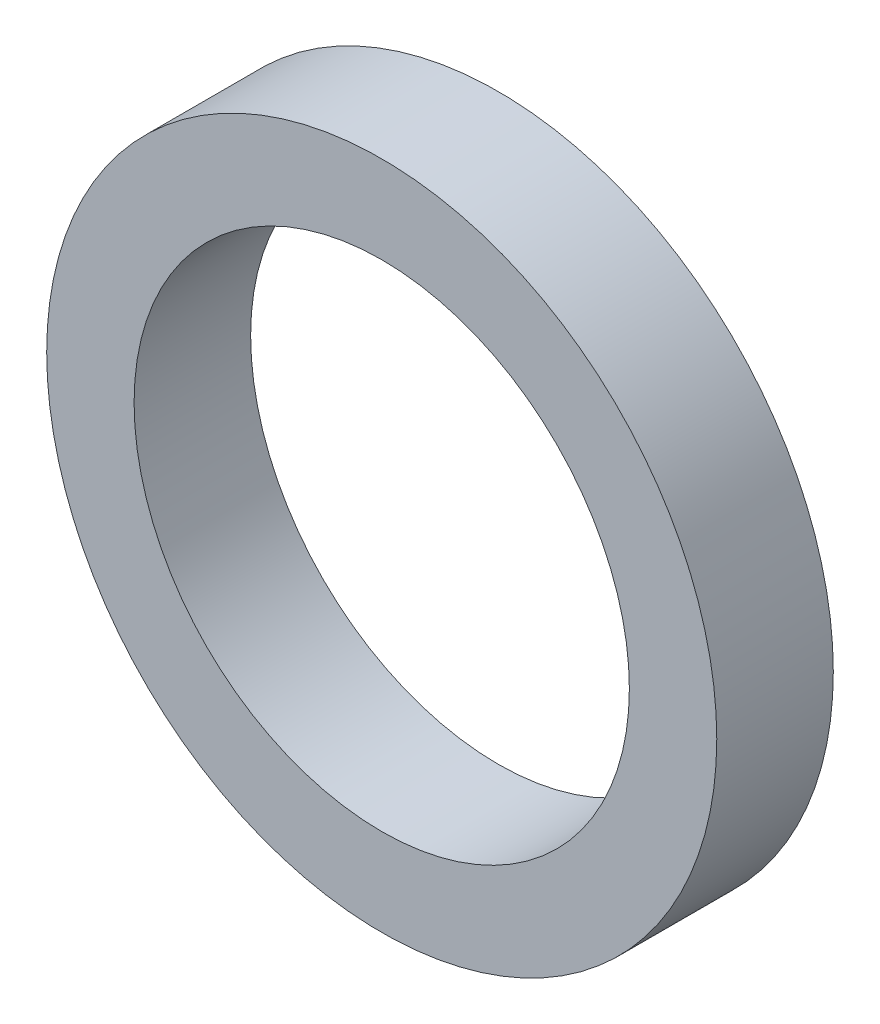
ISO-10303-21;
HEADER;
FILE_DESCRIPTION(('STEP AP214'),'2;1');
FILE_NAME('part.step','',(''),(''),'','','');
FILE_SCHEMA(('AUTOMOTIVE_DESIGN { 1 0 10303 214 1 1 1 1 }'));
ENDSEC;
DATA;
#1=APPLICATION_CONTEXT('core data for automotive mechanical design processes');
#2=APPLICATION_PROTOCOL_DEFINITION('international standard','automotive_design',2000,#1);
#3=PRODUCT_CONTEXT('',#1,'mechanical');
#4=PRODUCT('Part','Part','',(#3));
#5=PRODUCT_RELATED_PRODUCT_CATEGORY('part','',(#4));
#6=PRODUCT_DEFINITION_FORMATION('','',#4);
#7=PRODUCT_DEFINITION_CONTEXT('part definition',#1,'design');
#8=PRODUCT_DEFINITION('design','',#6,#7);
#9=PRODUCT_DEFINITION_SHAPE('','',#8);
#10=(LENGTH_UNIT() NAMED_UNIT(*) SI_UNIT(.MILLI.,.METRE.));
#11=(NAMED_UNIT(*) PLANE_ANGLE_UNIT() SI_UNIT($,.RADIAN.));
#12=(NAMED_UNIT(*) SI_UNIT($,.STERADIAN.) SOLID_ANGLE_UNIT());
#13=UNCERTAINTY_MEASURE_WITH_UNIT(LENGTH_MEASURE(1.E-05),#10,'distance_accuracy_value','');
#14=(GEOMETRIC_REPRESENTATION_CONTEXT(3) GLOBAL_UNCERTAINTY_ASSIGNED_CONTEXT((#13)) GLOBAL_UNIT_ASSIGNED_CONTEXT((#10,
#11,#12)) REPRESENTATION_CONTEXT('',''));
#15=CARTESIAN_POINT('',(0.,0.,0.));
#16=DIRECTION('',(0.,0.,1.));
#17=DIRECTION('',(1.,0.,0.));
#18=AXIS2_PLACEMENT_3D('',#15,#16,#17);
#19=CARTESIAN_POINT('',(0.,0.,4.));
#20=DIRECTION('',(0.,0.,1.));
#21=DIRECTION('',(1.,0.,0.));
#22=AXIS2_PLACEMENT_3D('',#19,#20,#21);
#23=PLANE('',#22);
#24=CARTESIAN_POINT('',(0.,0.,4.));
#25=DIRECTION('',(0.,0.,1.));
#26=DIRECTION('',(1.,0.,0.));
#27=AXIS2_PLACEMENT_3D('',#24,#25,#26);
#28=CIRCLE('',#27,11.5);
#29=CARTESIAN_POINT('',(11.5,0.,4.));
#30=VERTEX_POINT('',#29);
#31=EDGE_CURVE('E10',#30,#30,#28,.T.);
#32=ORIENTED_EDGE('',*,*,#31,.T.);
#33=EDGE_LOOP('',(#32));
#34=FACE_BOUND('',#33,.T.);
#35=CARTESIAN_POINT('',(0.,0.,4.));
#36=DIRECTION('',(0.,0.,1.));
#37=DIRECTION('',(1.,0.,0.));
#38=AXIS2_PLACEMENT_3D('',#35,#36,#37);
#39=CIRCLE('',#38,8.5);
#40=CARTESIAN_POINT('',(8.5,0.,4.));
#41=VERTEX_POINT('',#40);
#42=EDGE_CURVE('E50',#41,#41,#39,.T.);
#43=ORIENTED_EDGE('',*,*,#42,.F.);
#44=EDGE_LOOP('',(#43));
#45=FACE_BOUND('',#44,.T.);
#46=ADVANCED_FACE('F37',(#34,#45),#23,.T.);
#47=CARTESIAN_POINT('',(0.,0.,0.));
#48=DIRECTION('',(0.,0.,1.));
#49=DIRECTION('',(1.,0.,0.));
#50=AXIS2_PLACEMENT_3D('',#47,#48,#49);
#51=PLANE('',#50);
#52=CARTESIAN_POINT('',(0.,0.,0.));
#53=DIRECTION('',(0.,0.,1.));
#54=DIRECTION('',(1.,0.,0.));
#55=AXIS2_PLACEMENT_3D('',#52,#53,#54);
#56=CIRCLE('',#55,11.5);
#57=CARTESIAN_POINT('',(11.5,0.,0.));
#58=VERTEX_POINT('',#57);
#59=EDGE_CURVE('E41',#58,#58,#56,.T.);
#60=ORIENTED_EDGE('',*,*,#59,.F.);
#61=EDGE_LOOP('',(#60));
#62=FACE_BOUND('',#61,.T.);
#63=CARTESIAN_POINT('',(0.,0.,0.));
#64=DIRECTION('',(0.,0.,1.));
#65=DIRECTION('',(1.,0.,0.));
#66=AXIS2_PLACEMENT_3D('',#63,#64,#65);
#67=CIRCLE('',#66,8.5);
#68=CARTESIAN_POINT('',(8.5,0.,0.));
#69=VERTEX_POINT('',#68);
#70=EDGE_CURVE('E52',#69,#69,#67,.T.);
#71=ORIENTED_EDGE('',*,*,#70,.T.);
#72=EDGE_LOOP('',(#71));
#73=FACE_BOUND('',#72,.T.);
#74=ADVANCED_FACE('F64',(#62,#73),#51,.F.);
#75=CARTESIAN_POINT('',(0.,0.,4.));
#76=DIRECTION('',(0.,0.,-1.));
#77=DIRECTION('',(-1.,0.,0.));
#78=AXIS2_PLACEMENT_3D('',#75,#76,#77);
#79=CYLINDRICAL_SURFACE('',#78,11.5);
#80=ORIENTED_EDGE('',*,*,#31,.F.);
#81=EDGE_LOOP('',(#80));
#82=FACE_BOUND('',#81,.T.);
#83=ORIENTED_EDGE('',*,*,#59,.T.);
#84=EDGE_LOOP('',(#83));
#85=FACE_BOUND('',#84,.T.);
#86=ADVANCED_FACE('F39',(#82,#85),#79,.T.);
#87=CARTESIAN_POINT('',(0.,0.,4.));
#88=DIRECTION('',(0.,0.,-1.));
#89=DIRECTION('',(-1.,0.,0.));
#90=AXIS2_PLACEMENT_3D('',#87,#88,#89);
#91=CYLINDRICAL_SURFACE('',#90,8.5);
#92=ORIENTED_EDGE('',*,*,#42,.T.);
#93=EDGE_LOOP('',(#92));
#94=FACE_BOUND('',#93,.T.);
#95=ORIENTED_EDGE('',*,*,#70,.F.);
#96=EDGE_LOOP('',(#95));
#97=FACE_BOUND('',#96,.T.);
#98=ADVANCED_FACE('F60',(#94,#97),#91,.F.);
#99=CLOSED_SHELL('',(#46,#74,#86,#98));
#100=MANIFOLD_SOLID_BREP('B2',#99);
#101=ADVANCED_BREP_SHAPE_REPRESENTATION('',(#18,#100),#14);
#102=SHAPE_DEFINITION_REPRESENTATION(#9,#101);
ENDSEC;
END-ISO-10303-21;
